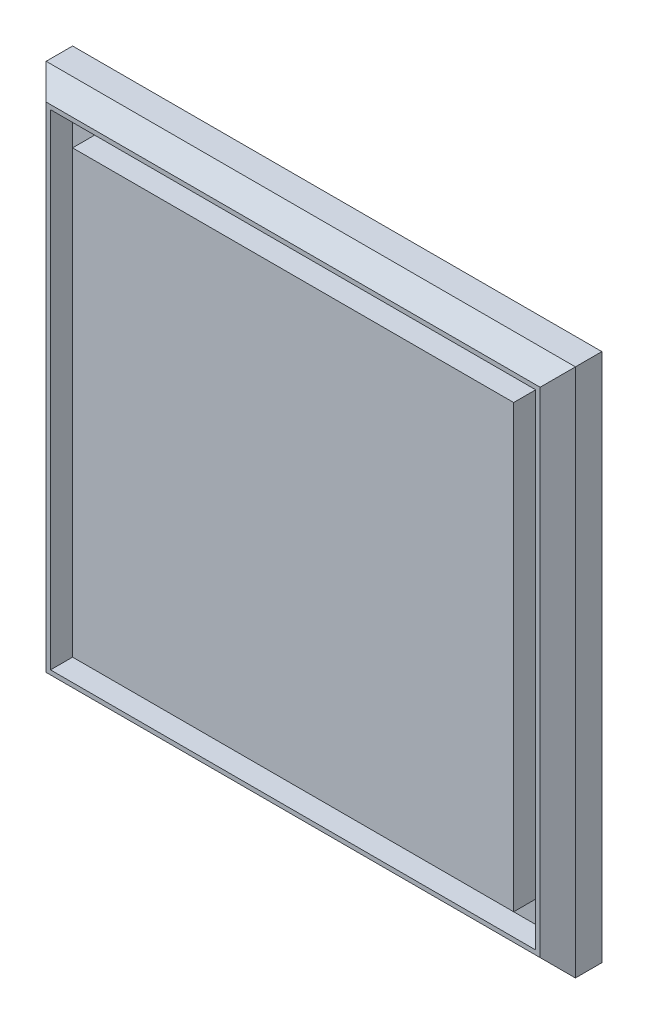
ISO-10303-21;
HEADER;
FILE_DESCRIPTION(('STEP AP214'),'2;1');
FILE_NAME('part.step','',(''),(''),'','','');
FILE_SCHEMA(('AUTOMOTIVE_DESIGN { 1 0 10303 214 1 1 1 1 }'));
ENDSEC;
DATA;
#1=APPLICATION_CONTEXT('core data for automotive mechanical design processes');
#2=APPLICATION_PROTOCOL_DEFINITION('international standard','automotive_design',2000,#1);
#3=PRODUCT_CONTEXT('',#1,'mechanical');
#4=PRODUCT('Part','Part','',(#3));
#5=PRODUCT_RELATED_PRODUCT_CATEGORY('part','',(#4));
#6=PRODUCT_DEFINITION_FORMATION('','',#4);
#7=PRODUCT_DEFINITION_CONTEXT('part definition',#1,'design');
#8=PRODUCT_DEFINITION('design','',#6,#7);
#9=PRODUCT_DEFINITION_SHAPE('','',#8);
#10=(LENGTH_UNIT() NAMED_UNIT(*) SI_UNIT(.MILLI.,.METRE.));
#11=(NAMED_UNIT(*) PLANE_ANGLE_UNIT() SI_UNIT($,.RADIAN.));
#12=(NAMED_UNIT(*) SI_UNIT($,.STERADIAN.) SOLID_ANGLE_UNIT());
#13=UNCERTAINTY_MEASURE_WITH_UNIT(LENGTH_MEASURE(1.E-05),#10,'distance_accuracy_value','');
#14=(GEOMETRIC_REPRESENTATION_CONTEXT(3) GLOBAL_UNCERTAINTY_ASSIGNED_CONTEXT((#13)) GLOBAL_UNIT_ASSIGNED_CONTEXT((#10,
#11,#12)) REPRESENTATION_CONTEXT('',''));
#15=CARTESIAN_POINT('',(0.,0.,0.));
#16=DIRECTION('',(0.,0.,1.));
#17=DIRECTION('',(1.,0.,0.));
#18=AXIS2_PLACEMENT_3D('',#15,#16,#17);
#19=CARTESIAN_POINT('',(-120.,120.,20.));
#20=DIRECTION('',(0.,1.,0.));
#21=DIRECTION('',(0.,0.,1.));
#22=AXIS2_PLACEMENT_3D('',#19,#20,#21);
#23=PLANE('',#22);
#24=DIRECTION('',(0.,0.,-1.));
#25=VECTOR('',#24,1.);
#26=CARTESIAN_POINT('',(-120.,120.,20.));
#27=LINE('',#26,#25);
#28=CARTESIAN_POINT('',(-120.,120.,12.));
#29=VERTEX_POINT('',#28);
#30=CARTESIAN_POINT('',(-120.,120.,0.));
#31=VERTEX_POINT('',#30);
#32=EDGE_CURVE('E225',#29,#31,#27,.T.);
#33=ORIENTED_EDGE('',*,*,#32,.F.);
#34=DIRECTION('',(1.,0.,0.));
#35=VECTOR('',#34,1.);
#36=CARTESIAN_POINT('',(120.,120.,12.));
#37=LINE('',#36,#35);
#38=CARTESIAN_POINT('',(120.,120.,12.));
#39=VERTEX_POINT('',#38);
#40=EDGE_CURVE('E11',#29,#39,#37,.T.);
#41=ORIENTED_EDGE('',*,*,#40,.T.);
#42=DIRECTION('',(0.,0.,-1.));
#43=VECTOR('',#42,1.);
#44=CARTESIAN_POINT('',(120.,120.,20.));
#45=LINE('',#44,#43);
#46=CARTESIAN_POINT('',(120.,120.,0.));
#47=VERTEX_POINT('',#46);
#48=EDGE_CURVE('E224',#39,#47,#45,.T.);
#49=ORIENTED_EDGE('',*,*,#48,.T.);
#50=DIRECTION('',(1.,0.,0.));
#51=VECTOR('',#50,1.);
#52=CARTESIAN_POINT('',(-120.,120.,0.));
#53=LINE('',#52,#51);
#54=EDGE_CURVE('E212',#31,#47,#53,.T.);
#55=ORIENTED_EDGE('',*,*,#54,.F.);
#56=EDGE_LOOP('',(#33,#41,#49,#55));
#57=FACE_BOUND('',#56,.T.);
#58=ADVANCED_FACE('F37',(#57),#23,.T.);
#59=CARTESIAN_POINT('',(-120.,120.,20.));
#60=DIRECTION('',(1.,0.,0.));
#61=DIRECTION('',(0.,1.,0.));
#62=AXIS2_PLACEMENT_3D('',#59,#60,#61);
#63=PLANE('',#62);
#64=DIRECTION('',(0.,0.,-1.));
#65=VECTOR('',#64,1.);
#66=CARTESIAN_POINT('',(-120.,-120.,20.));
#67=LINE('',#66,#65);
#68=CARTESIAN_POINT('',(-120.,-120.,12.));
#69=VERTEX_POINT('',#68);
#70=CARTESIAN_POINT('',(-120.,-120.,0.));
#71=VERTEX_POINT('',#70);
#72=EDGE_CURVE('E228',#69,#71,#67,.T.);
#73=ORIENTED_EDGE('',*,*,#72,.F.);
#74=DIRECTION('',(0.,1.,0.));
#75=VECTOR('',#74,1.);
#76=CARTESIAN_POINT('',(-120.,120.,12.));
#77=LINE('',#76,#75);
#78=EDGE_CURVE('E47',#69,#29,#77,.T.);
#79=ORIENTED_EDGE('',*,*,#78,.T.);
#80=ORIENTED_EDGE('',*,*,#32,.T.);
#81=DIRECTION('',(0.,-1.,0.));
#82=VECTOR('',#81,1.);
#83=CARTESIAN_POINT('',(-120.,120.,0.));
#84=LINE('',#83,#82);
#85=EDGE_CURVE('E221',#31,#71,#84,.T.);
#86=ORIENTED_EDGE('',*,*,#85,.T.);
#87=EDGE_LOOP('',(#73,#79,#80,#86));
#88=FACE_BOUND('',#87,.T.);
#89=ADVANCED_FACE('F289',(#88),#63,.F.);
#90=CARTESIAN_POINT('',(-120.,-120.,20.));
#91=DIRECTION('',(0.,1.,0.));
#92=DIRECTION('',(0.,0.,1.));
#93=AXIS2_PLACEMENT_3D('',#90,#91,#92);
#94=PLANE('',#93);
#95=DIRECTION('',(0.,0.,-1.));
#96=VECTOR('',#95,1.);
#97=CARTESIAN_POINT('',(120.,-120.,20.));
#98=LINE('',#97,#96);
#99=CARTESIAN_POINT('',(120.,-120.,12.));
#100=VERTEX_POINT('',#99);
#101=CARTESIAN_POINT('',(120.,-120.,0.));
#102=VERTEX_POINT('',#101);
#103=EDGE_CURVE('E230',#100,#102,#98,.T.);
#104=ORIENTED_EDGE('',*,*,#103,.F.);
#105=DIRECTION('',(-1.,0.,0.));
#106=VECTOR('',#105,1.);
#107=CARTESIAN_POINT('',(-120.,-120.,12.));
#108=LINE('',#107,#106);
#109=EDGE_CURVE('E244',#100,#69,#108,.T.);
#110=ORIENTED_EDGE('',*,*,#109,.T.);
#111=ORIENTED_EDGE('',*,*,#72,.T.);
#112=DIRECTION('',(1.,0.,0.));
#113=VECTOR('',#112,1.);
#114=CARTESIAN_POINT('',(-120.,-120.,0.));
#115=LINE('',#114,#113);
#116=EDGE_CURVE('E218',#71,#102,#115,.T.);
#117=ORIENTED_EDGE('',*,*,#116,.T.);
#118=EDGE_LOOP('',(#104,#110,#111,#117));
#119=FACE_BOUND('',#118,.T.);
#120=ADVANCED_FACE('F280',(#119),#94,.F.);
#121=CARTESIAN_POINT('',(120.,120.,20.));
#122=DIRECTION('',(1.,0.,0.));
#123=DIRECTION('',(0.,1.,0.));
#124=AXIS2_PLACEMENT_3D('',#121,#122,#123);
#125=PLANE('',#124);
#126=ORIENTED_EDGE('',*,*,#48,.F.);
#127=DIRECTION('',(0.,-1.,0.));
#128=VECTOR('',#127,1.);
#129=CARTESIAN_POINT('',(120.,-120.,12.));
#130=LINE('',#129,#128);
#131=EDGE_CURVE('E227',#39,#100,#130,.T.);
#132=ORIENTED_EDGE('',*,*,#131,.T.);
#133=ORIENTED_EDGE('',*,*,#103,.T.);
#134=DIRECTION('',(0.,-1.,0.));
#135=VECTOR('',#134,1.);
#136=CARTESIAN_POINT('',(120.,120.,0.));
#137=LINE('',#136,#135);
#138=EDGE_CURVE('E215',#47,#102,#137,.T.);
#139=ORIENTED_EDGE('',*,*,#138,.F.);
#140=EDGE_LOOP('',(#126,#132,#133,#139));
#141=FACE_BOUND('',#140,.T.);
#142=ADVANCED_FACE('F278',(#141),#125,.T.);
#143=CARTESIAN_POINT('',(0.,0.,20.));
#144=DIRECTION('',(0.,0.,-1.));
#145=DIRECTION('',(-1.,0.,0.));
#146=AXIS2_PLACEMENT_3D('',#143,#144,#145);
#147=PLANE('',#146);
#148=DIRECTION('',(1.,0.,0.));
#149=VECTOR('',#148,1.);
#150=CARTESIAN_POINT('',(110.,-110.,20.));
#151=LINE('',#150,#149);
#152=CARTESIAN_POINT('',(-110.,-110.,20.));
#153=VERTEX_POINT('',#152);
#154=CARTESIAN_POINT('',(110.,-110.,20.));
#155=VERTEX_POINT('',#154);
#156=EDGE_CURVE('E196',#153,#155,#151,.T.);
#157=ORIENTED_EDGE('',*,*,#156,.F.);
#158=DIRECTION('',(0.,-1.,0.));
#159=VECTOR('',#158,1.);
#160=CARTESIAN_POINT('',(-110.,-110.,20.));
#161=LINE('',#160,#159);
#162=CARTESIAN_POINT('',(-110.,110.,20.));
#163=VERTEX_POINT('',#162);
#164=EDGE_CURVE('E55',#163,#153,#161,.T.);
#165=ORIENTED_EDGE('',*,*,#164,.F.);
#166=DIRECTION('',(-1.,0.,0.));
#167=VECTOR('',#166,1.);
#168=CARTESIAN_POINT('',(110.,110.,20.));
#169=LINE('',#168,#167);
#170=CARTESIAN_POINT('',(110.,110.,20.));
#171=VERTEX_POINT('',#170);
#172=EDGE_CURVE('E185',#171,#163,#169,.T.);
#173=ORIENTED_EDGE('',*,*,#172,.F.);
#174=DIRECTION('',(0.,1.,0.));
#175=VECTOR('',#174,1.);
#176=CARTESIAN_POINT('',(110.,-110.,20.));
#177=LINE('',#176,#175);
#178=EDGE_CURVE('E199',#155,#171,#177,.T.);
#179=ORIENTED_EDGE('',*,*,#178,.F.);
#180=EDGE_LOOP('',(#157,#165,#173,#179));
#181=FACE_BOUND('',#180,.T.);
#182=DIRECTION('',(1.,0.,0.));
#183=VECTOR('',#182,1.);
#184=CARTESIAN_POINT('',(0.,-112.,20.));
#185=LINE('',#184,#183);
#186=CARTESIAN_POINT('',(-112.,-112.,20.));
#187=VERTEX_POINT('',#186);
#188=CARTESIAN_POINT('',(112.,-112.,20.));
#189=VERTEX_POINT('',#188);
#190=EDGE_CURVE('E239',#187,#189,#185,.T.);
#191=ORIENTED_EDGE('',*,*,#190,.T.);
#192=DIRECTION('',(0.,1.,0.));
#193=VECTOR('',#192,1.);
#194=CARTESIAN_POINT('',(112.,120.,20.));
#195=LINE('',#194,#193);
#196=CARTESIAN_POINT('',(112.,112.,20.));
#197=VERTEX_POINT('',#196);
#198=EDGE_CURVE('E241',#189,#197,#195,.T.);
#199=ORIENTED_EDGE('',*,*,#198,.T.);
#200=DIRECTION('',(-1.,0.,0.));
#201=VECTOR('',#200,1.);
#202=CARTESIAN_POINT('',(-120.,112.,20.));
#203=LINE('',#202,#201);
#204=CARTESIAN_POINT('',(-112.,112.,20.));
#205=VERTEX_POINT('',#204);
#206=EDGE_CURVE('E235',#197,#205,#203,.T.);
#207=ORIENTED_EDGE('',*,*,#206,.T.);
#208=DIRECTION('',(0.,-1.,0.));
#209=VECTOR('',#208,1.);
#210=CARTESIAN_POINT('',(-112.,0.,20.));
#211=LINE('',#210,#209);
#212=EDGE_CURVE('E237',#205,#187,#211,.T.);
#213=ORIENTED_EDGE('',*,*,#212,.T.);
#214=EDGE_LOOP('',(#191,#199,#207,#213));
#215=FACE_BOUND('',#214,.T.);
#216=ADVANCED_FACE('F266',(#181,#215),#147,.F.);
#217=CARTESIAN_POINT('',(0.,0.,0.));
#218=DIRECTION('',(0.,0.,-1.));
#219=DIRECTION('',(-1.,0.,0.));
#220=AXIS2_PLACEMENT_3D('',#217,#218,#219);
#221=PLANE('',#220);
#222=ORIENTED_EDGE('',*,*,#54,.T.);
#223=ORIENTED_EDGE('',*,*,#138,.T.);
#224=ORIENTED_EDGE('',*,*,#116,.F.);
#225=ORIENTED_EDGE('',*,*,#85,.F.);
#226=EDGE_LOOP('',(#222,#223,#224,#225));
#227=FACE_BOUND('',#226,.T.);
#228=ADVANCED_FACE('F284',(#227),#221,.T.);
#229=CARTESIAN_POINT('',(-112.,0.,20.));
#230=DIRECTION('',(0.707106781186546,0.,-0.707106781186549));
#231=DIRECTION('',(0.,-1.,0.));
#232=AXIS2_PLACEMENT_3D('',#229,#230,#231);
#233=PLANE('',#232);
#234=DIRECTION('',(0.577350269189627,0.577350269189626,0.577350269189624));
#235=VECTOR('',#234,1.);
#236=CARTESIAN_POINT('',(-74.6666666666665,-74.6666666666666,57.3333333333333));
#237=LINE('',#236,#235);
#238=EDGE_CURVE('E249',#187,#69,#237,.F.);
#239=ORIENTED_EDGE('',*,*,#238,.F.);
#240=ORIENTED_EDGE('',*,*,#212,.F.);
#241=DIRECTION('',(-0.577350269189627,0.577350269189626,-0.577350269189624));
#242=VECTOR('',#241,1.);
#243=CARTESIAN_POINT('',(-120.,120.,12.));
#244=LINE('',#243,#242);
#245=EDGE_CURVE('E42',#29,#205,#244,.F.);
#246=ORIENTED_EDGE('',*,*,#245,.F.);
#247=ORIENTED_EDGE('',*,*,#78,.F.);
#248=EDGE_LOOP('',(#239,#240,#246,#247));
#249=FACE_BOUND('',#248,.T.);
#250=ADVANCED_FACE('F40',(#249),#233,.F.);
#251=CARTESIAN_POINT('',(-120.,120.,12.));
#252=DIRECTION('',(0.,0.707106781186546,0.707106781186549));
#253=DIRECTION('',(-1.,0.,0.));
#254=AXIS2_PLACEMENT_3D('',#251,#252,#253);
#255=PLANE('',#254);
#256=ORIENTED_EDGE('',*,*,#245,.T.);
#257=ORIENTED_EDGE('',*,*,#206,.F.);
#258=DIRECTION('',(0.577350269189626,0.577350269189627,-0.577350269189625));
#259=VECTOR('',#258,1.);
#260=CARTESIAN_POINT('',(39.9999999999998,39.9999999999998,91.9999999999999));
#261=LINE('',#260,#259);
#262=EDGE_CURVE('E248',#39,#197,#261,.F.);
#263=ORIENTED_EDGE('',*,*,#262,.F.);
#264=ORIENTED_EDGE('',*,*,#40,.F.);
#265=EDGE_LOOP('',(#256,#257,#263,#264));
#266=FACE_BOUND('',#265,.T.);
#267=ADVANCED_FACE('F260',(#266),#255,.T.);
#268=CARTESIAN_POINT('',(0.,-112.,20.));
#269=DIRECTION('',(0.,0.707106781186546,-0.707106781186549));
#270=DIRECTION('',(1.,0.,0.));
#271=AXIS2_PLACEMENT_3D('',#268,#269,#270);
#272=PLANE('',#271);
#273=ORIENTED_EDGE('',*,*,#238,.T.);
#274=ORIENTED_EDGE('',*,*,#109,.F.);
#275=DIRECTION('',(0.577350269189627,-0.577350269189626,-0.577350269189624));
#276=VECTOR('',#275,1.);
#277=CARTESIAN_POINT('',(74.6666666666665,-74.6666666666665,57.3333333333333));
#278=LINE('',#277,#276);
#279=EDGE_CURVE('E206',#189,#100,#278,.T.);
#280=ORIENTED_EDGE('',*,*,#279,.F.);
#281=ORIENTED_EDGE('',*,*,#190,.F.);
#282=EDGE_LOOP('',(#273,#274,#280,#281));
#283=FACE_BOUND('',#282,.T.);
#284=ADVANCED_FACE('F272',(#283),#272,.F.);
#285=CARTESIAN_POINT('',(120.,120.,12.));
#286=DIRECTION('',(0.707106781186546,0.,0.707106781186549));
#287=DIRECTION('',(0.,1.,0.));
#288=AXIS2_PLACEMENT_3D('',#285,#286,#287);
#289=PLANE('',#288);
#290=ORIENTED_EDGE('',*,*,#262,.T.);
#291=ORIENTED_EDGE('',*,*,#198,.F.);
#292=ORIENTED_EDGE('',*,*,#279,.T.);
#293=ORIENTED_EDGE('',*,*,#131,.F.);
#294=EDGE_LOOP('',(#290,#291,#292,#293));
#295=FACE_BOUND('',#294,.T.);
#296=ADVANCED_FACE('F270',(#295),#289,.T.);
#297=CARTESIAN_POINT('',(-110.,-110.,10.));
#298=DIRECTION('',(-1.,0.,0.));
#299=DIRECTION('',(0.,0.,1.));
#300=AXIS2_PLACEMENT_3D('',#297,#298,#299);
#301=PLANE('',#300);
#302=ORIENTED_EDGE('',*,*,#164,.T.);
#303=DIRECTION('',(0.,0.,1.));
#304=VECTOR('',#303,1.);
#305=CARTESIAN_POINT('',(-110.,-110.,10.));
#306=LINE('',#305,#304);
#307=CARTESIAN_POINT('',(-110.,-110.,10.));
#308=VERTEX_POINT('',#307);
#309=EDGE_CURVE('E194',#308,#153,#306,.T.);
#310=ORIENTED_EDGE('',*,*,#309,.F.);
#311=DIRECTION('',(0.,-1.,0.));
#312=VECTOR('',#311,1.);
#313=CARTESIAN_POINT('',(-110.,-110.,10.));
#314=LINE('',#313,#312);
#315=CARTESIAN_POINT('',(-110.,110.,10.));
#316=VERTEX_POINT('',#315);
#317=EDGE_CURVE('E181',#316,#308,#314,.T.);
#318=ORIENTED_EDGE('',*,*,#317,.F.);
#319=DIRECTION('',(0.,0.,1.));
#320=VECTOR('',#319,1.);
#321=CARTESIAN_POINT('',(-110.,110.,10.));
#322=LINE('',#321,#320);
#323=EDGE_CURVE('E204',#316,#163,#322,.T.);
#324=ORIENTED_EDGE('',*,*,#323,.T.);
#325=EDGE_LOOP('',(#302,#310,#318,#324));
#326=FACE_BOUND('',#325,.T.);
#327=ADVANCED_FACE('F309',(#326),#301,.F.);
#328=CARTESIAN_POINT('',(110.,110.,10.));
#329=DIRECTION('',(0.,1.,0.));
#330=DIRECTION('',(0.,0.,1.));
#331=AXIS2_PLACEMENT_3D('',#328,#329,#330);
#332=PLANE('',#331);
#333=ORIENTED_EDGE('',*,*,#172,.T.);
#334=ORIENTED_EDGE('',*,*,#323,.F.);
#335=DIRECTION('',(-1.,0.,0.));
#336=VECTOR('',#335,1.);
#337=CARTESIAN_POINT('',(110.,110.,10.));
#338=LINE('',#337,#336);
#339=CARTESIAN_POINT('',(110.,110.,10.));
#340=VERTEX_POINT('',#339);
#341=EDGE_CURVE('E191',#340,#316,#338,.T.);
#342=ORIENTED_EDGE('',*,*,#341,.F.);
#343=DIRECTION('',(0.,0.,1.));
#344=VECTOR('',#343,1.);
#345=CARTESIAN_POINT('',(110.,110.,10.));
#346=LINE('',#345,#344);
#347=EDGE_CURVE('E207',#340,#171,#346,.T.);
#348=ORIENTED_EDGE('',*,*,#347,.T.);
#349=EDGE_LOOP('',(#333,#334,#342,#348));
#350=FACE_BOUND('',#349,.T.);
#351=ADVANCED_FACE('F354',(#350),#332,.F.);
#352=CARTESIAN_POINT('',(110.,-110.,10.));
#353=DIRECTION('',(1.,0.,0.));
#354=DIRECTION('',(0.,0.,-1.));
#355=AXIS2_PLACEMENT_3D('',#352,#353,#354);
#356=PLANE('',#355);
#357=ORIENTED_EDGE('',*,*,#178,.T.);
#358=ORIENTED_EDGE('',*,*,#347,.F.);
#359=DIRECTION('',(0.,1.,0.));
#360=VECTOR('',#359,1.);
#361=CARTESIAN_POINT('',(110.,-110.,10.));
#362=LINE('',#361,#360);
#363=CARTESIAN_POINT('',(110.,-110.,10.));
#364=VERTEX_POINT('',#363);
#365=EDGE_CURVE('E188',#364,#340,#362,.T.);
#366=ORIENTED_EDGE('',*,*,#365,.F.);
#367=DIRECTION('',(0.,0.,1.));
#368=VECTOR('',#367,1.);
#369=CARTESIAN_POINT('',(110.,-110.,10.));
#370=LINE('',#369,#368);
#371=EDGE_CURVE('E209',#364,#155,#370,.T.);
#372=ORIENTED_EDGE('',*,*,#371,.T.);
#373=EDGE_LOOP('',(#357,#358,#366,#372));
#374=FACE_BOUND('',#373,.T.);
#375=ADVANCED_FACE('F357',(#374),#356,.F.);
#376=CARTESIAN_POINT('',(110.,-110.,10.));
#377=DIRECTION('',(0.,-1.,0.));
#378=DIRECTION('',(0.,0.,-1.));
#379=AXIS2_PLACEMENT_3D('',#376,#377,#378);
#380=PLANE('',#379);
#381=ORIENTED_EDGE('',*,*,#156,.T.);
#382=ORIENTED_EDGE('',*,*,#371,.F.);
#383=DIRECTION('',(1.,0.,0.));
#384=VECTOR('',#383,1.);
#385=CARTESIAN_POINT('',(110.,-110.,10.));
#386=LINE('',#385,#384);
#387=EDGE_CURVE('E184',#308,#364,#386,.T.);
#388=ORIENTED_EDGE('',*,*,#387,.F.);
#389=ORIENTED_EDGE('',*,*,#309,.T.);
#390=EDGE_LOOP('',(#381,#382,#388,#389));
#391=FACE_BOUND('',#390,.T.);
#392=ADVANCED_FACE('F353',(#391),#380,.F.);
#393=CARTESIAN_POINT('',(0.,0.,10.));
#394=DIRECTION('',(0.,0.,1.));
#395=DIRECTION('',(1.,0.,0.));
#396=AXIS2_PLACEMENT_3D('',#393,#394,#395);
#397=PLANE('',#396);
#398=DIRECTION('',(-1.,0.,0.));
#399=VECTOR('',#398,1.);
#400=CARTESIAN_POINT('',(100.,100.,10.));
#401=LINE('',#400,#399);
#402=CARTESIAN_POINT('',(100.,100.,10.));
#403=VERTEX_POINT('',#402);
#404=CARTESIAN_POINT('',(-100.,100.,10.));
#405=VERTEX_POINT('',#404);
#406=EDGE_CURVE('E152',#403,#405,#401,.T.);
#407=ORIENTED_EDGE('',*,*,#406,.F.);
#408=DIRECTION('',(0.,1.,0.));
#409=VECTOR('',#408,1.);
#410=CARTESIAN_POINT('',(100.,-100.,10.));
#411=LINE('',#410,#409);
#412=CARTESIAN_POINT('',(100.,-100.,10.));
#413=VERTEX_POINT('',#412);
#414=EDGE_CURVE('E162',#413,#403,#411,.T.);
#415=ORIENTED_EDGE('',*,*,#414,.F.);
#416=DIRECTION('',(1.,0.,0.));
#417=VECTOR('',#416,1.);
#418=CARTESIAN_POINT('',(100.,-100.,10.));
#419=LINE('',#418,#417);
#420=CARTESIAN_POINT('',(-100.,-100.,10.));
#421=VERTEX_POINT('',#420);
#422=EDGE_CURVE('E144',#421,#413,#419,.T.);
#423=ORIENTED_EDGE('',*,*,#422,.F.);
#424=DIRECTION('',(0.,-1.,0.));
#425=VECTOR('',#424,1.);
#426=CARTESIAN_POINT('',(-100.,-100.,10.));
#427=LINE('',#426,#425);
#428=EDGE_CURVE('E159',#405,#421,#427,.T.);
#429=ORIENTED_EDGE('',*,*,#428,.F.);
#430=EDGE_LOOP('',(#407,#415,#423,#429));
#431=FACE_BOUND('',#430,.T.);
#432=ORIENTED_EDGE('',*,*,#317,.T.);
#433=ORIENTED_EDGE('',*,*,#387,.T.);
#434=ORIENTED_EDGE('',*,*,#365,.T.);
#435=ORIENTED_EDGE('',*,*,#341,.T.);
#436=EDGE_LOOP('',(#432,#433,#434,#435));
#437=FACE_BOUND('',#436,.T.);
#438=ADVANCED_FACE('F157',(#431,#437),#397,.T.);
#439=CARTESIAN_POINT('',(-100.,-100.,10.));
#440=DIRECTION('',(-1.,0.,0.));
#441=DIRECTION('',(0.,0.,1.));
#442=AXIS2_PLACEMENT_3D('',#439,#440,#441);
#443=PLANE('',#442);
#444=DIRECTION('',(0.,-1.,0.));
#445=VECTOR('',#444,1.);
#446=CARTESIAN_POINT('',(-100.,-100.,20.));
#447=LINE('',#446,#445);
#448=CARTESIAN_POINT('',(-100.,100.,20.));
#449=VERTEX_POINT('',#448);
#450=CARTESIAN_POINT('',(-100.,-100.,20.));
#451=VERTEX_POINT('',#450);
#452=EDGE_CURVE('E173',#449,#451,#447,.T.);
#453=ORIENTED_EDGE('',*,*,#452,.F.);
#454=DIRECTION('',(0.,0.,1.));
#455=VECTOR('',#454,1.);
#456=CARTESIAN_POINT('',(-100.,100.,10.));
#457=LINE('',#456,#455);
#458=EDGE_CURVE('E165',#405,#449,#457,.T.);
#459=ORIENTED_EDGE('',*,*,#458,.F.);
#460=ORIENTED_EDGE('',*,*,#428,.T.);
#461=DIRECTION('',(0.,0.,1.));
#462=VECTOR('',#461,1.);
#463=CARTESIAN_POINT('',(-100.,-100.,10.));
#464=LINE('',#463,#462);
#465=EDGE_CURVE('E141',#421,#451,#464,.T.);
#466=ORIENTED_EDGE('',*,*,#465,.T.);
#467=EDGE_LOOP('',(#453,#459,#460,#466));
#468=FACE_BOUND('',#467,.T.);
#469=ADVANCED_FACE('F164',(#468),#443,.T.);
#470=CARTESIAN_POINT('',(100.,100.,10.));
#471=DIRECTION('',(0.,1.,0.));
#472=DIRECTION('',(0.,0.,1.));
#473=AXIS2_PLACEMENT_3D('',#470,#471,#472);
#474=PLANE('',#473);
#475=DIRECTION('',(-1.,0.,0.));
#476=VECTOR('',#475,1.);
#477=CARTESIAN_POINT('',(100.,100.,20.));
#478=LINE('',#477,#476);
#479=CARTESIAN_POINT('',(100.,100.,20.));
#480=VERTEX_POINT('',#479);
#481=EDGE_CURVE('E166',#480,#449,#478,.T.);
#482=ORIENTED_EDGE('',*,*,#481,.F.);
#483=DIRECTION('',(0.,0.,1.));
#484=VECTOR('',#483,1.);
#485=CARTESIAN_POINT('',(100.,100.,10.));
#486=LINE('',#485,#484);
#487=EDGE_CURVE('E178',#403,#480,#486,.T.);
#488=ORIENTED_EDGE('',*,*,#487,.F.);
#489=ORIENTED_EDGE('',*,*,#406,.T.);
#490=ORIENTED_EDGE('',*,*,#458,.T.);
#491=EDGE_LOOP('',(#482,#488,#489,#490));
#492=FACE_BOUND('',#491,.T.);
#493=ADVANCED_FACE('F341',(#492),#474,.T.);
#494=CARTESIAN_POINT('',(100.,-100.,10.));
#495=DIRECTION('',(1.,0.,0.));
#496=DIRECTION('',(0.,0.,-1.));
#497=AXIS2_PLACEMENT_3D('',#494,#495,#496);
#498=PLANE('',#497);
#499=DIRECTION('',(0.,1.,0.));
#500=VECTOR('',#499,1.);
#501=CARTESIAN_POINT('',(100.,-100.,20.));
#502=LINE('',#501,#500);
#503=CARTESIAN_POINT('',(100.,-100.,20.));
#504=VERTEX_POINT('',#503);
#505=EDGE_CURVE('E63',#504,#480,#502,.T.);
#506=ORIENTED_EDGE('',*,*,#505,.F.);
#507=DIRECTION('',(0.,0.,1.));
#508=VECTOR('',#507,1.);
#509=CARTESIAN_POINT('',(100.,-100.,10.));
#510=LINE('',#509,#508);
#511=EDGE_CURVE('E151',#413,#504,#510,.T.);
#512=ORIENTED_EDGE('',*,*,#511,.F.);
#513=ORIENTED_EDGE('',*,*,#414,.T.);
#514=ORIENTED_EDGE('',*,*,#487,.T.);
#515=EDGE_LOOP('',(#506,#512,#513,#514));
#516=FACE_BOUND('',#515,.T.);
#517=ADVANCED_FACE('F337',(#516),#498,.T.);
#518=CARTESIAN_POINT('',(100.,-100.,10.));
#519=DIRECTION('',(0.,-1.,0.));
#520=DIRECTION('',(0.,0.,-1.));
#521=AXIS2_PLACEMENT_3D('',#518,#519,#520);
#522=PLANE('',#521);
#523=DIRECTION('',(1.,0.,0.));
#524=VECTOR('',#523,1.);
#525=CARTESIAN_POINT('',(100.,-100.,20.));
#526=LINE('',#525,#524);
#527=EDGE_CURVE('E146',#451,#504,#526,.T.);
#528=ORIENTED_EDGE('',*,*,#527,.F.);
#529=ORIENTED_EDGE('',*,*,#465,.F.);
#530=ORIENTED_EDGE('',*,*,#422,.T.);
#531=ORIENTED_EDGE('',*,*,#511,.T.);
#532=EDGE_LOOP('',(#528,#529,#530,#531));
#533=FACE_BOUND('',#532,.T.);
#534=ADVANCED_FACE('F143',(#533),#522,.T.);
#535=ORIENTED_EDGE('',*,*,#452,.T.);
#536=ORIENTED_EDGE('',*,*,#527,.T.);
#537=ORIENTED_EDGE('',*,*,#505,.T.);
#538=ORIENTED_EDGE('',*,*,#481,.T.);
#539=EDGE_LOOP('',(#535,#536,#537,#538));
#540=FACE_BOUND('',#539,.T.);
#541=ADVANCED_FACE('F327',(#540),#147,.F.);
#542=CLOSED_SHELL('',(#58,#89,#120,#142,#216,#228,#250,#267,#284,#296,#327,#351,#375,#392,#438,
#469,#493,#517,#534,#541));
#543=MANIFOLD_SOLID_BREP('B2',#542);
#544=ADVANCED_BREP_SHAPE_REPRESENTATION('',(#18,#543),#14);
#545=SHAPE_DEFINITION_REPRESENTATION(#9,#544);
ENDSEC;
END-ISO-10303-21;
